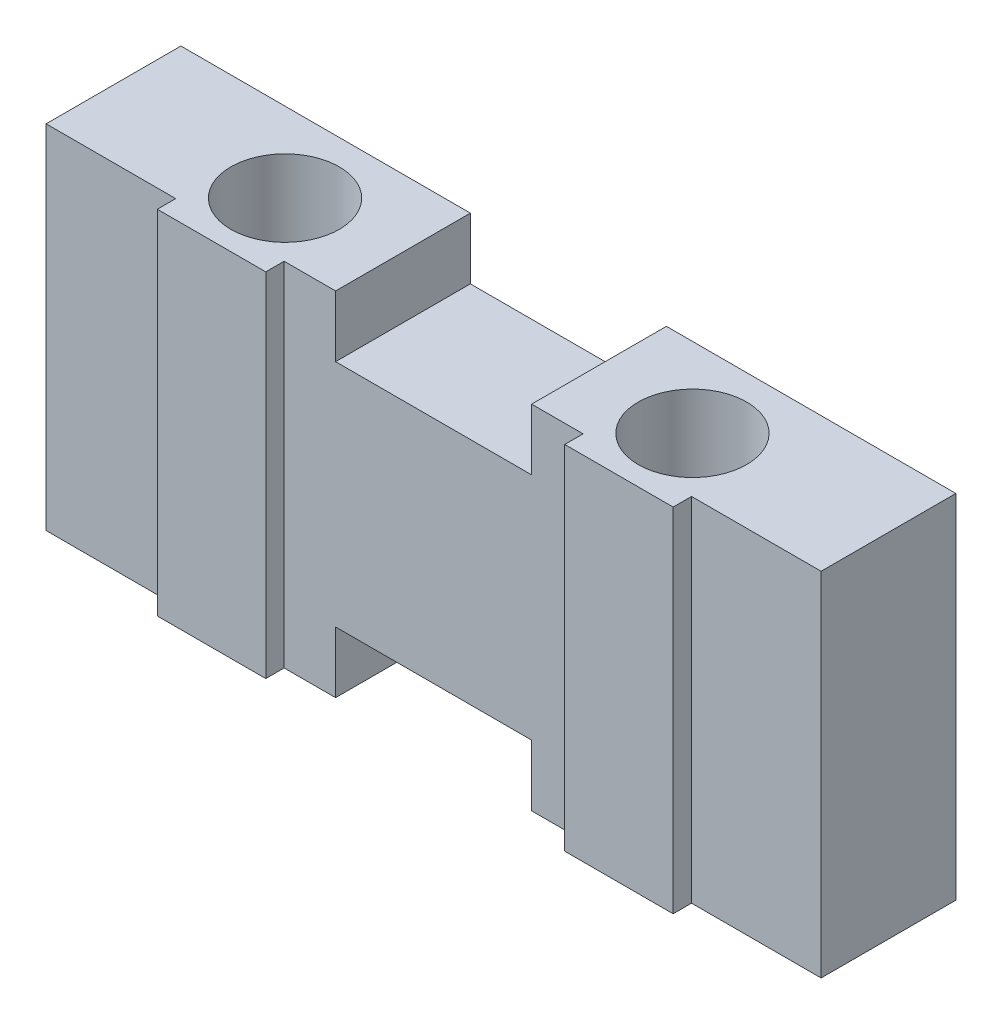
ISO-10303-21;
HEADER;
FILE_DESCRIPTION(('STEP AP214'),'2;1');
FILE_NAME('part.step','',(''),(''),'','','');
FILE_SCHEMA(('AUTOMOTIVE_DESIGN { 1 0 10303 214 1 1 1 1 }'));
ENDSEC;
DATA;
#1=APPLICATION_CONTEXT('core data for automotive mechanical design processes');
#2=APPLICATION_PROTOCOL_DEFINITION('international standard','automotive_design',2000,#1);
#3=PRODUCT_CONTEXT('',#1,'mechanical');
#4=PRODUCT('Part','Part','',(#3));
#5=PRODUCT_RELATED_PRODUCT_CATEGORY('part','',(#4));
#6=PRODUCT_DEFINITION_FORMATION('','',#4);
#7=PRODUCT_DEFINITION_CONTEXT('part definition',#1,'design');
#8=PRODUCT_DEFINITION('design','',#6,#7);
#9=PRODUCT_DEFINITION_SHAPE('','',#8);
#10=(LENGTH_UNIT() NAMED_UNIT(*) SI_UNIT(.MILLI.,.METRE.));
#11=(NAMED_UNIT(*) PLANE_ANGLE_UNIT() SI_UNIT($,.RADIAN.));
#12=(NAMED_UNIT(*) SI_UNIT($,.STERADIAN.) SOLID_ANGLE_UNIT());
#13=UNCERTAINTY_MEASURE_WITH_UNIT(LENGTH_MEASURE(1.E-05),#10,'distance_accuracy_value','');
#14=(GEOMETRIC_REPRESENTATION_CONTEXT(3) GLOBAL_UNCERTAINTY_ASSIGNED_CONTEXT((#13)) GLOBAL_UNIT_ASSIGNED_CONTEXT((#10,
#11,#12)) REPRESENTATION_CONTEXT('',''));
#15=CARTESIAN_POINT('',(0.,0.,0.));
#16=DIRECTION('',(0.,0.,1.));
#17=DIRECTION('',(1.,0.,0.));
#18=AXIS2_PLACEMENT_3D('',#15,#16,#17);
#19=CARTESIAN_POINT('',(-1.6,5.75,2.5));
#20=DIRECTION('',(0.,-1.,0.));
#21=DIRECTION('',(0.,0.,-1.));
#22=AXIS2_PLACEMENT_3D('',#19,#20,#21);
#23=PLANE('',#22);
#24=CARTESIAN_POINT('',(-3.325,5.75,1.3));
#25=DIRECTION('',(0.,1.,0.));
#26=DIRECTION('',(0.,0.,1.));
#27=AXIS2_PLACEMENT_3D('',#24,#25,#26);
#28=CIRCLE('',#27,0.885);
#29=CARTESIAN_POINT('',(-3.325,5.75,2.185));
#30=VERTEX_POINT('',#29);
#31=EDGE_CURVE('E280',#30,#30,#28,.T.);
#32=ORIENTED_EDGE('',*,*,#31,.F.);
#33=EDGE_LOOP('',(#32));
#34=FACE_BOUND('',#33,.T.);
#35=DIRECTION('',(1.,0.,0.));
#36=VECTOR('',#35,1.);
#37=CARTESIAN_POINT('',(-6.325,5.75,2.2));
#38=LINE('',#37,#36);
#39=CARTESIAN_POINT('',(-6.325,5.75,2.2));
#40=VERTEX_POINT('',#39);
#41=CARTESIAN_POINT('',(-4.21,5.75,2.2));
#42=VERTEX_POINT('',#41);
#43=EDGE_CURVE('E48',#40,#42,#38,.T.);
#44=ORIENTED_EDGE('',*,*,#43,.T.);
#45=DIRECTION('',(0.,0.,1.));
#46=VECTOR('',#45,1.);
#47=CARTESIAN_POINT('',(-4.21,5.75,2.2));
#48=LINE('',#47,#46);
#49=CARTESIAN_POINT('',(-4.21,5.75,2.5));
#50=VERTEX_POINT('',#49);
#51=EDGE_CURVE('E185',#42,#50,#48,.T.);
#52=ORIENTED_EDGE('',*,*,#51,.T.);
#53=DIRECTION('',(-1.,0.,0.));
#54=VECTOR('',#53,1.);
#55=CARTESIAN_POINT('',(-1.6,5.75,2.5));
#56=LINE('',#55,#54);
#57=CARTESIAN_POINT('',(-2.44,5.75,2.5));
#58=VERTEX_POINT('',#57);
#59=EDGE_CURVE('E270',#58,#50,#56,.T.);
#60=ORIENTED_EDGE('',*,*,#59,.F.);
#61=DIRECTION('',(0.,0.,-1.));
#62=VECTOR('',#61,1.);
#63=CARTESIAN_POINT('',(-2.44,5.75,0.));
#64=LINE('',#63,#62);
#65=CARTESIAN_POINT('',(-2.44,5.75,2.2));
#66=VERTEX_POINT('',#65);
#67=EDGE_CURVE('E321',#58,#66,#64,.T.);
#68=ORIENTED_EDGE('',*,*,#67,.T.);
#69=DIRECTION('',(1.,0.,0.));
#70=VECTOR('',#69,1.);
#71=CARTESIAN_POINT('',(0.,5.75,2.2));
#72=LINE('',#71,#70);
#73=CARTESIAN_POINT('',(-1.6,5.75,2.2));
#74=VERTEX_POINT('',#73);
#75=EDGE_CURVE('E318',#66,#74,#72,.T.);
#76=ORIENTED_EDGE('',*,*,#75,.T.);
#77=DIRECTION('',(0.,0.,-1.));
#78=VECTOR('',#77,1.);
#79=CARTESIAN_POINT('',(-1.6,5.75,2.5));
#80=LINE('',#79,#78);
#81=CARTESIAN_POINT('',(-1.6,5.75,0.));
#82=VERTEX_POINT('',#81);
#83=EDGE_CURVE('E194',#74,#82,#80,.T.);
#84=ORIENTED_EDGE('',*,*,#83,.T.);
#85=DIRECTION('',(-1.,0.,0.));
#86=VECTOR('',#85,1.);
#87=CARTESIAN_POINT('',(-1.6,5.75,0.));
#88=LINE('',#87,#86);
#89=CARTESIAN_POINT('',(-6.325,5.75,0.));
#90=VERTEX_POINT('',#89);
#91=EDGE_CURVE('E257',#82,#90,#88,.T.);
#92=ORIENTED_EDGE('',*,*,#91,.T.);
#93=DIRECTION('',(0.,0.,-1.));
#94=VECTOR('',#93,1.);
#95=CARTESIAN_POINT('',(-6.325,5.75,2.5));
#96=LINE('',#95,#94);
#97=EDGE_CURVE('E191',#40,#90,#96,.T.);
#98=ORIENTED_EDGE('',*,*,#97,.F.);
#99=EDGE_LOOP('',(#44,#52,#60,#68,#76,#84,#92,#98));
#100=FACE_BOUND('',#99,.T.);
#101=ADVANCED_FACE('F33',(#34,#100),#23,.F.);
#102=CARTESIAN_POINT('',(-6.325,0.,2.5));
#103=DIRECTION('',(0.,1.,0.));
#104=DIRECTION('',(0.,0.,1.));
#105=AXIS2_PLACEMENT_3D('',#102,#103,#104);
#106=PLANE('',#105);
#107=CARTESIAN_POINT('',(-3.325,0.,1.3));
#108=DIRECTION('',(0.,1.,0.));
#109=DIRECTION('',(0.,0.,1.));
#110=AXIS2_PLACEMENT_3D('',#107,#108,#109);
#111=CIRCLE('',#110,0.885);
#112=CARTESIAN_POINT('',(-3.325,0.,2.185));
#113=VERTEX_POINT('',#112);
#114=EDGE_CURVE('E273',#113,#113,#111,.F.);
#115=ORIENTED_EDGE('',*,*,#114,.F.);
#116=EDGE_LOOP('',(#115));
#117=FACE_BOUND('',#116,.T.);
#118=DIRECTION('',(-1.,0.,0.));
#119=VECTOR('',#118,1.);
#120=CARTESIAN_POINT('',(-6.325,0.,2.2));
#121=LINE('',#120,#119);
#122=CARTESIAN_POINT('',(-4.21,0.,2.2));
#123=VERTEX_POINT('',#122);
#124=CARTESIAN_POINT('',(-6.325,0.,2.2));
#125=VERTEX_POINT('',#124);
#126=EDGE_CURVE('E171',#123,#125,#121,.T.);
#127=ORIENTED_EDGE('',*,*,#126,.T.);
#128=DIRECTION('',(0.,0.,-1.));
#129=VECTOR('',#128,1.);
#130=CARTESIAN_POINT('',(-6.325,0.,2.5));
#131=LINE('',#130,#129);
#132=CARTESIAN_POINT('',(-6.325,0.,0.));
#133=VERTEX_POINT('',#132);
#134=EDGE_CURVE('E181',#125,#133,#131,.T.);
#135=ORIENTED_EDGE('',*,*,#134,.T.);
#136=DIRECTION('',(1.,0.,0.));
#137=VECTOR('',#136,1.);
#138=CARTESIAN_POINT('',(-6.325,0.,0.));
#139=LINE('',#138,#137);
#140=CARTESIAN_POINT('',(-1.6,0.,0.));
#141=VERTEX_POINT('',#140);
#142=EDGE_CURVE('E260',#133,#141,#139,.T.);
#143=ORIENTED_EDGE('',*,*,#142,.T.);
#144=DIRECTION('',(0.,0.,-1.));
#145=VECTOR('',#144,1.);
#146=CARTESIAN_POINT('',(-1.6,0.,2.5));
#147=LINE('',#146,#145);
#148=CARTESIAN_POINT('',(-1.6,0.,2.2));
#149=VERTEX_POINT('',#148);
#150=EDGE_CURVE('E192',#149,#141,#147,.T.);
#151=ORIENTED_EDGE('',*,*,#150,.F.);
#152=DIRECTION('',(-1.,0.,0.));
#153=VECTOR('',#152,1.);
#154=CARTESIAN_POINT('',(0.,0.,2.2));
#155=LINE('',#154,#153);
#156=CARTESIAN_POINT('',(-2.44,0.,2.2));
#157=VERTEX_POINT('',#156);
#158=EDGE_CURVE('E299',#149,#157,#155,.T.);
#159=ORIENTED_EDGE('',*,*,#158,.T.);
#160=DIRECTION('',(0.,0.,1.));
#161=VECTOR('',#160,1.);
#162=CARTESIAN_POINT('',(-2.44,0.,0.));
#163=LINE('',#162,#161);
#164=CARTESIAN_POINT('',(-2.44,0.,2.5));
#165=VERTEX_POINT('',#164);
#166=EDGE_CURVE('E331',#157,#165,#163,.T.);
#167=ORIENTED_EDGE('',*,*,#166,.T.);
#168=DIRECTION('',(1.,0.,0.));
#169=VECTOR('',#168,1.);
#170=CARTESIAN_POINT('',(-6.325,0.,2.5));
#171=LINE('',#170,#169);
#172=CARTESIAN_POINT('',(-4.21,0.,2.5));
#173=VERTEX_POINT('',#172);
#174=EDGE_CURVE('E196',#173,#165,#171,.T.);
#175=ORIENTED_EDGE('',*,*,#174,.F.);
#176=DIRECTION('',(0.,0.,-1.));
#177=VECTOR('',#176,1.);
#178=CARTESIAN_POINT('',(-4.21,0.,2.2));
#179=LINE('',#178,#177);
#180=EDGE_CURVE('E184',#173,#123,#179,.T.);
#181=ORIENTED_EDGE('',*,*,#180,.T.);
#182=EDGE_LOOP('',(#127,#135,#143,#151,#159,#167,#175,#181));
#183=FACE_BOUND('',#182,.T.);
#184=ADVANCED_FACE('F179',(#117,#183),#106,.F.);
#185=CARTESIAN_POINT('',(-1.6,1.,2.5));
#186=DIRECTION('',(0.,0.,-1.));
#187=DIRECTION('',(-1.,0.,0.));
#188=AXIS2_PLACEMENT_3D('',#185,#186,#187);
#189=PLANE('',#188);
#190=DIRECTION('',(0.,1.,0.));
#191=VECTOR('',#190,1.);
#192=CARTESIAN_POINT('',(-4.21,-0.00100000000000013,2.5));
#193=LINE('',#192,#191);
#194=EDGE_CURVE('E359',#173,#50,#193,.T.);
#195=ORIENTED_EDGE('',*,*,#194,.F.);
#196=ORIENTED_EDGE('',*,*,#174,.T.);
#197=DIRECTION('',(0.,1.,0.));
#198=VECTOR('',#197,1.);
#199=CARTESIAN_POINT('',(-2.44,-0.00100000000000013,2.5));
#200=LINE('',#199,#198);
#201=EDGE_CURVE('E334',#165,#58,#200,.T.);
#202=ORIENTED_EDGE('',*,*,#201,.T.);
#203=ORIENTED_EDGE('',*,*,#59,.T.);
#204=EDGE_LOOP('',(#195,#196,#202,#203));
#205=FACE_BOUND('',#204,.T.);
#206=ADVANCED_FACE('F369',(#205),#189,.F.);
#207=CARTESIAN_POINT('',(-6.325,5.75,2.5));
#208=DIRECTION('',(1.,0.,0.));
#209=DIRECTION('',(0.,0.,-1.));
#210=AXIS2_PLACEMENT_3D('',#207,#208,#209);
#211=PLANE('',#210);
#212=DIRECTION('',(0.,1.,0.));
#213=VECTOR('',#212,1.);
#214=CARTESIAN_POINT('',(-6.325,-0.00100000000000013,2.2));
#215=LINE('',#214,#213);
#216=EDGE_CURVE('E168',#125,#40,#215,.T.);
#217=ORIENTED_EDGE('',*,*,#216,.T.);
#218=ORIENTED_EDGE('',*,*,#97,.T.);
#219=DIRECTION('',(0.,-1.,0.));
#220=VECTOR('',#219,1.);
#221=CARTESIAN_POINT('',(-6.325,5.75,0.));
#222=LINE('',#221,#220);
#223=EDGE_CURVE('E189',#90,#133,#222,.T.);
#224=ORIENTED_EDGE('',*,*,#223,.T.);
#225=ORIENTED_EDGE('',*,*,#134,.F.);
#226=EDGE_LOOP('',(#217,#218,#224,#225));
#227=FACE_BOUND('',#226,.T.);
#228=ADVANCED_FACE('F187',(#227),#211,.F.);
#229=CARTESIAN_POINT('',(1.6,0.,2.5));
#230=DIRECTION('',(0.,1.,0.));
#231=DIRECTION('',(0.,0.,1.));
#232=AXIS2_PLACEMENT_3D('',#229,#230,#231);
#233=PLANE('',#232);
#234=CARTESIAN_POINT('',(3.325,0.,1.3));
#235=DIRECTION('',(0.,1.,0.));
#236=DIRECTION('',(0.,0.,1.));
#237=AXIS2_PLACEMENT_3D('',#234,#235,#236);
#238=CIRCLE('',#237,0.885);
#239=CARTESIAN_POINT('',(3.325,0.,2.185));
#240=VERTEX_POINT('',#239);
#241=EDGE_CURVE('E288',#240,#240,#238,.F.);
#242=ORIENTED_EDGE('',*,*,#241,.F.);
#243=EDGE_LOOP('',(#242));
#244=FACE_BOUND('',#243,.T.);
#245=DIRECTION('',(0.,0.,1.));
#246=VECTOR('',#245,1.);
#247=CARTESIAN_POINT('',(4.21,0.,0.));
#248=LINE('',#247,#246);
#249=CARTESIAN_POINT('',(4.21,0.,2.2));
#250=VERTEX_POINT('',#249);
#251=CARTESIAN_POINT('',(4.21,0.,2.5));
#252=VERTEX_POINT('',#251);
#253=EDGE_CURVE('E341',#250,#252,#248,.T.);
#254=ORIENTED_EDGE('',*,*,#253,.T.);
#255=DIRECTION('',(1.,0.,0.));
#256=VECTOR('',#255,1.);
#257=CARTESIAN_POINT('',(1.6,0.,2.5));
#258=LINE('',#257,#256);
#259=CARTESIAN_POINT('',(2.44,0.,2.5));
#260=VERTEX_POINT('',#259);
#261=EDGE_CURVE('E261',#260,#252,#258,.T.);
#262=ORIENTED_EDGE('',*,*,#261,.F.);
#263=DIRECTION('',(0.,0.,-1.));
#264=VECTOR('',#263,1.);
#265=CARTESIAN_POINT('',(2.44,0.,0.));
#266=LINE('',#265,#264);
#267=CARTESIAN_POINT('',(2.44,0.,2.2));
#268=VERTEX_POINT('',#267);
#269=EDGE_CURVE('E305',#260,#268,#266,.T.);
#270=ORIENTED_EDGE('',*,*,#269,.T.);
#271=DIRECTION('',(-1.,0.,0.));
#272=VECTOR('',#271,1.);
#273=CARTESIAN_POINT('',(0.,0.,2.2));
#274=LINE('',#273,#272);
#275=CARTESIAN_POINT('',(1.6,0.,2.2));
#276=VERTEX_POINT('',#275);
#277=EDGE_CURVE('E308',#268,#276,#274,.T.);
#278=ORIENTED_EDGE('',*,*,#277,.T.);
#279=DIRECTION('',(0.,0.,-1.));
#280=VECTOR('',#279,1.);
#281=CARTESIAN_POINT('',(1.6,0.,2.5));
#282=LINE('',#281,#280);
#283=CARTESIAN_POINT('',(1.6,0.,0.));
#284=VERTEX_POINT('',#283);
#285=EDGE_CURVE('E211',#276,#284,#282,.T.);
#286=ORIENTED_EDGE('',*,*,#285,.T.);
#287=DIRECTION('',(1.,0.,0.));
#288=VECTOR('',#287,1.);
#289=CARTESIAN_POINT('',(1.6,0.,0.));
#290=LINE('',#289,#288);
#291=CARTESIAN_POINT('',(6.325,0.,0.));
#292=VERTEX_POINT('',#291);
#293=EDGE_CURVE('E237',#284,#292,#290,.T.);
#294=ORIENTED_EDGE('',*,*,#293,.T.);
#295=DIRECTION('',(0.,0.,-1.));
#296=VECTOR('',#295,1.);
#297=CARTESIAN_POINT('',(6.325,0.,2.5));
#298=LINE('',#297,#296);
#299=CARTESIAN_POINT('',(6.325,0.,2.2));
#300=VERTEX_POINT('',#299);
#301=EDGE_CURVE('E209',#300,#292,#298,.T.);
#302=ORIENTED_EDGE('',*,*,#301,.F.);
#303=DIRECTION('',(-1.,0.,0.));
#304=VECTOR('',#303,1.);
#305=CARTESIAN_POINT('',(0.,0.,2.2));
#306=LINE('',#305,#304);
#307=EDGE_CURVE('E56',#300,#250,#306,.T.);
#308=ORIENTED_EDGE('',*,*,#307,.T.);
#309=EDGE_LOOP('',(#254,#262,#270,#278,#286,#294,#302,#308));
#310=FACE_BOUND('',#309,.T.);
#311=ADVANCED_FACE('F410',(#244,#310),#233,.F.);
#312=CARTESIAN_POINT('',(6.325,5.75,2.5));
#313=DIRECTION('',(0.,-1.,0.));
#314=DIRECTION('',(0.,0.,-1.));
#315=AXIS2_PLACEMENT_3D('',#312,#313,#314);
#316=PLANE('',#315);
#317=CARTESIAN_POINT('',(3.325,5.75,1.3));
#318=DIRECTION('',(0.,1.,0.));
#319=DIRECTION('',(0.,0.,1.));
#320=AXIS2_PLACEMENT_3D('',#317,#318,#319);
#321=CIRCLE('',#320,0.885);
#322=CARTESIAN_POINT('',(3.325,5.75,2.185));
#323=VERTEX_POINT('',#322);
#324=EDGE_CURVE('E284',#323,#323,#321,.T.);
#325=ORIENTED_EDGE('',*,*,#324,.F.);
#326=EDGE_LOOP('',(#325));
#327=FACE_BOUND('',#326,.T.);
#328=DIRECTION('',(0.,0.,-1.));
#329=VECTOR('',#328,1.);
#330=CARTESIAN_POINT('',(4.21,5.75,0.));
#331=LINE('',#330,#329);
#332=CARTESIAN_POINT('',(4.21,5.75,2.5));
#333=VERTEX_POINT('',#332);
#334=CARTESIAN_POINT('',(4.21,5.75,2.2));
#335=VERTEX_POINT('',#334);
#336=EDGE_CURVE('E347',#333,#335,#331,.T.);
#337=ORIENTED_EDGE('',*,*,#336,.T.);
#338=DIRECTION('',(1.,0.,0.));
#339=VECTOR('',#338,1.);
#340=CARTESIAN_POINT('',(0.,5.75,2.2));
#341=LINE('',#340,#339);
#342=CARTESIAN_POINT('',(6.325,5.75,2.2));
#343=VERTEX_POINT('',#342);
#344=EDGE_CURVE('E344',#335,#343,#341,.T.);
#345=ORIENTED_EDGE('',*,*,#344,.T.);
#346=DIRECTION('',(0.,0.,-1.));
#347=VECTOR('',#346,1.);
#348=CARTESIAN_POINT('',(6.325,5.75,2.5));
#349=LINE('',#348,#347);
#350=CARTESIAN_POINT('',(6.325,5.75,0.));
#351=VERTEX_POINT('',#350);
#352=EDGE_CURVE('E207',#343,#351,#349,.T.);
#353=ORIENTED_EDGE('',*,*,#352,.T.);
#354=DIRECTION('',(-1.,0.,0.));
#355=VECTOR('',#354,1.);
#356=CARTESIAN_POINT('',(6.325,5.75,0.));
#357=LINE('',#356,#355);
#358=CARTESIAN_POINT('',(1.6,5.75,0.));
#359=VERTEX_POINT('',#358);
#360=EDGE_CURVE('E245',#351,#359,#357,.T.);
#361=ORIENTED_EDGE('',*,*,#360,.T.);
#362=DIRECTION('',(0.,0.,-1.));
#363=VECTOR('',#362,1.);
#364=CARTESIAN_POINT('',(1.6,5.75,2.5));
#365=LINE('',#364,#363);
#366=CARTESIAN_POINT('',(1.6,5.75,2.2));
#367=VERTEX_POINT('',#366);
#368=EDGE_CURVE('E205',#367,#359,#365,.T.);
#369=ORIENTED_EDGE('',*,*,#368,.F.);
#370=CARTESIAN_POINT('',(2.44,5.75,2.2));
#371=VERTEX_POINT('',#370);
#372=EDGE_CURVE('E317',#367,#371,#72,.T.);
#373=ORIENTED_EDGE('',*,*,#372,.T.);
#374=DIRECTION('',(0.,0.,1.));
#375=VECTOR('',#374,1.);
#376=CARTESIAN_POINT('',(2.44,5.75,0.));
#377=LINE('',#376,#375);
#378=CARTESIAN_POINT('',(2.44,5.75,2.5));
#379=VERTEX_POINT('',#378);
#380=EDGE_CURVE('E324',#371,#379,#377,.T.);
#381=ORIENTED_EDGE('',*,*,#380,.T.);
#382=DIRECTION('',(-1.,0.,0.));
#383=VECTOR('',#382,1.);
#384=CARTESIAN_POINT('',(6.325,5.75,2.5));
#385=LINE('',#384,#383);
#386=EDGE_CURVE('E264',#333,#379,#385,.T.);
#387=ORIENTED_EDGE('',*,*,#386,.F.);
#388=EDGE_LOOP('',(#337,#345,#353,#361,#369,#373,#381,#387));
#389=FACE_BOUND('',#388,.T.);
#390=ADVANCED_FACE('F408',(#327,#389),#316,.F.);
#391=DIRECTION('',(0.,1.,0.));
#392=VECTOR('',#391,1.);
#393=CARTESIAN_POINT('',(4.21,-0.00100000000000013,2.5));
#394=LINE('',#393,#392);
#395=EDGE_CURVE('E351',#252,#333,#394,.T.);
#396=ORIENTED_EDGE('',*,*,#395,.T.);
#397=ORIENTED_EDGE('',*,*,#386,.T.);
#398=DIRECTION('',(0.,1.,0.));
#399=VECTOR('',#398,1.);
#400=CARTESIAN_POINT('',(2.44,-0.00100000000000013,2.5));
#401=LINE('',#400,#399);
#402=EDGE_CURVE('E330',#260,#379,#401,.T.);
#403=ORIENTED_EDGE('',*,*,#402,.F.);
#404=ORIENTED_EDGE('',*,*,#261,.T.);
#405=EDGE_LOOP('',(#396,#397,#403,#404));
#406=FACE_BOUND('',#405,.T.);
#407=ADVANCED_FACE('F383',(#406),#189,.F.);
#408=CARTESIAN_POINT('',(6.325,0.,2.5));
#409=DIRECTION('',(-1.,0.,0.));
#410=DIRECTION('',(0.,0.,1.));
#411=AXIS2_PLACEMENT_3D('',#408,#409,#410);
#412=PLANE('',#411);
#413=DIRECTION('',(0.,1.,0.));
#414=VECTOR('',#413,1.);
#415=CARTESIAN_POINT('',(6.325,-0.00100000000000013,2.2));
#416=LINE('',#415,#414);
#417=EDGE_CURVE('E350',#300,#343,#416,.T.);
#418=ORIENTED_EDGE('',*,*,#417,.F.);
#419=ORIENTED_EDGE('',*,*,#301,.T.);
#420=DIRECTION('',(0.,1.,0.));
#421=VECTOR('',#420,1.);
#422=CARTESIAN_POINT('',(6.325,0.,0.));
#423=LINE('',#422,#421);
#424=EDGE_CURVE('E239',#292,#351,#423,.T.);
#425=ORIENTED_EDGE('',*,*,#424,.T.);
#426=ORIENTED_EDGE('',*,*,#352,.F.);
#427=EDGE_LOOP('',(#418,#419,#425,#426));
#428=FACE_BOUND('',#427,.T.);
#429=ADVANCED_FACE('F378',(#428),#412,.F.);
#430=CARTESIAN_POINT('',(-1.6,0.,2.5));
#431=DIRECTION('',(-1.,0.,0.));
#432=DIRECTION('',(0.,0.,1.));
#433=AXIS2_PLACEMENT_3D('',#430,#431,#432);
#434=PLANE('',#433);
#435=DIRECTION('',(0.,-1.,0.));
#436=VECTOR('',#435,1.);
#437=CARTESIAN_POINT('',(-1.6,-0.00100000000000013,2.2));
#438=LINE('',#437,#436);
#439=CARTESIAN_POINT('',(-1.6,1.,2.2));
#440=VERTEX_POINT('',#439);
#441=EDGE_CURVE('E314',#440,#149,#438,.T.);
#442=ORIENTED_EDGE('',*,*,#441,.T.);
#443=ORIENTED_EDGE('',*,*,#150,.T.);
#444=DIRECTION('',(0.,1.,0.));
#445=VECTOR('',#444,1.);
#446=CARTESIAN_POINT('',(-1.6,0.,0.));
#447=LINE('',#446,#445);
#448=CARTESIAN_POINT('',(-1.6,1.,0.));
#449=VERTEX_POINT('',#448);
#450=EDGE_CURVE('E232',#141,#449,#447,.T.);
#451=ORIENTED_EDGE('',*,*,#450,.T.);
#452=DIRECTION('',(0.,0.,-1.));
#453=VECTOR('',#452,1.);
#454=CARTESIAN_POINT('',(-1.6,1.,2.5));
#455=LINE('',#454,#453);
#456=EDGE_CURVE('E11',#440,#449,#455,.T.);
#457=ORIENTED_EDGE('',*,*,#456,.F.);
#458=EDGE_LOOP('',(#442,#443,#451,#457));
#459=FACE_BOUND('',#458,.T.);
#460=ADVANCED_FACE('F35',(#459),#434,.F.);
#461=CARTESIAN_POINT('',(-1.6,1.,2.5));
#462=DIRECTION('',(0.,1.,0.));
#463=DIRECTION('',(0.,0.,1.));
#464=AXIS2_PLACEMENT_3D('',#461,#462,#463);
#465=PLANE('',#464);
#466=DIRECTION('',(-1.,0.,0.));
#467=VECTOR('',#466,1.);
#468=CARTESIAN_POINT('',(0.,1.,2.2));
#469=LINE('',#468,#467);
#470=CARTESIAN_POINT('',(1.6,1.,2.2));
#471=VERTEX_POINT('',#470);
#472=EDGE_CURVE('E312',#471,#440,#469,.T.);
#473=ORIENTED_EDGE('',*,*,#472,.T.);
#474=ORIENTED_EDGE('',*,*,#456,.T.);
#475=DIRECTION('',(1.,0.,0.));
#476=VECTOR('',#475,1.);
#477=CARTESIAN_POINT('',(-1.6,1.,0.));
#478=LINE('',#477,#476);
#479=CARTESIAN_POINT('',(1.6,1.,0.));
#480=VERTEX_POINT('',#479);
#481=EDGE_CURVE('E226',#449,#480,#478,.T.);
#482=ORIENTED_EDGE('',*,*,#481,.T.);
#483=DIRECTION('',(0.,0.,-1.));
#484=VECTOR('',#483,1.);
#485=CARTESIAN_POINT('',(1.6,1.,2.5));
#486=LINE('',#485,#484);
#487=EDGE_CURVE('E41',#471,#480,#486,.T.);
#488=ORIENTED_EDGE('',*,*,#487,.F.);
#489=EDGE_LOOP('',(#473,#474,#482,#488));
#490=FACE_BOUND('',#489,.T.);
#491=ADVANCED_FACE('F227',(#490),#465,.F.);
#492=CARTESIAN_POINT('',(1.6,1.,2.5));
#493=DIRECTION('',(1.,0.,0.));
#494=DIRECTION('',(0.,1.,0.));
#495=AXIS2_PLACEMENT_3D('',#492,#493,#494);
#496=PLANE('',#495);
#497=DIRECTION('',(0.,1.,0.));
#498=VECTOR('',#497,1.);
#499=CARTESIAN_POINT('',(1.6,-0.00100000000000083,2.2));
#500=LINE('',#499,#498);
#501=EDGE_CURVE('E222',#276,#471,#500,.T.);
#502=ORIENTED_EDGE('',*,*,#501,.T.);
#503=ORIENTED_EDGE('',*,*,#487,.T.);
#504=DIRECTION('',(0.,-1.,0.));
#505=VECTOR('',#504,1.);
#506=CARTESIAN_POINT('',(1.6,1.,0.));
#507=LINE('',#506,#505);
#508=EDGE_CURVE('E220',#480,#284,#507,.T.);
#509=ORIENTED_EDGE('',*,*,#508,.T.);
#510=ORIENTED_EDGE('',*,*,#285,.F.);
#511=EDGE_LOOP('',(#502,#503,#509,#510));
#512=FACE_BOUND('',#511,.T.);
#513=ADVANCED_FACE('F217',(#512),#496,.F.);
#514=CARTESIAN_POINT('',(1.6,5.75,2.5));
#515=DIRECTION('',(1.,0.,0.));
#516=DIRECTION('',(0.,0.,-1.));
#517=AXIS2_PLACEMENT_3D('',#514,#515,#516);
#518=PLANE('',#517);
#519=DIRECTION('',(0.,1.,0.));
#520=VECTOR('',#519,1.);
#521=CARTESIAN_POINT('',(1.6,-0.00100000000000013,2.2));
#522=LINE('',#521,#520);
#523=CARTESIAN_POINT('',(1.6,4.75,2.2));
#524=VERTEX_POINT('',#523);
#525=EDGE_CURVE('E296',#524,#367,#522,.T.);
#526=ORIENTED_EDGE('',*,*,#525,.T.);
#527=ORIENTED_EDGE('',*,*,#368,.T.);
#528=DIRECTION('',(0.,-1.,0.));
#529=VECTOR('',#528,1.);
#530=CARTESIAN_POINT('',(1.6,5.75,0.));
#531=LINE('',#530,#529);
#532=CARTESIAN_POINT('',(1.6,4.75,0.));
#533=VERTEX_POINT('',#532);
#534=EDGE_CURVE('E248',#359,#533,#531,.T.);
#535=ORIENTED_EDGE('',*,*,#534,.T.);
#536=DIRECTION('',(0.,0.,-1.));
#537=VECTOR('',#536,1.);
#538=CARTESIAN_POINT('',(1.6,4.75,2.5));
#539=LINE('',#538,#537);
#540=EDGE_CURVE('E203',#524,#533,#539,.T.);
#541=ORIENTED_EDGE('',*,*,#540,.F.);
#542=EDGE_LOOP('',(#526,#527,#535,#541));
#543=FACE_BOUND('',#542,.T.);
#544=ADVANCED_FACE('F403',(#543),#518,.F.);
#545=CARTESIAN_POINT('',(1.6,4.75,2.5));
#546=DIRECTION('',(0.,-1.,0.));
#547=DIRECTION('',(0.,0.,-1.));
#548=AXIS2_PLACEMENT_3D('',#545,#546,#547);
#549=PLANE('',#548);
#550=DIRECTION('',(1.,0.,0.));
#551=VECTOR('',#550,1.);
#552=CARTESIAN_POINT('',(0.,4.75,2.2));
#553=LINE('',#552,#551);
#554=CARTESIAN_POINT('',(-1.6,4.75,2.2));
#555=VERTEX_POINT('',#554);
#556=EDGE_CURVE('E302',#555,#524,#553,.T.);
#557=ORIENTED_EDGE('',*,*,#556,.T.);
#558=ORIENTED_EDGE('',*,*,#540,.T.);
#559=DIRECTION('',(-1.,0.,0.));
#560=VECTOR('',#559,1.);
#561=CARTESIAN_POINT('',(1.6,4.75,0.));
#562=LINE('',#561,#560);
#563=CARTESIAN_POINT('',(-1.6,4.75,0.));
#564=VERTEX_POINT('',#563);
#565=EDGE_CURVE('E251',#533,#564,#562,.T.);
#566=ORIENTED_EDGE('',*,*,#565,.T.);
#567=DIRECTION('',(0.,0.,-1.));
#568=VECTOR('',#567,1.);
#569=CARTESIAN_POINT('',(-1.6,4.75,2.5));
#570=LINE('',#569,#568);
#571=EDGE_CURVE('E201',#555,#564,#570,.T.);
#572=ORIENTED_EDGE('',*,*,#571,.F.);
#573=EDGE_LOOP('',(#557,#558,#566,#572));
#574=FACE_BOUND('',#573,.T.);
#575=ADVANCED_FACE('F399',(#574),#549,.F.);
#576=CARTESIAN_POINT('',(-1.6,4.75,2.5));
#577=DIRECTION('',(-1.,0.,0.));
#578=DIRECTION('',(0.,0.,1.));
#579=AXIS2_PLACEMENT_3D('',#576,#577,#578);
#580=PLANE('',#579);
#581=DIRECTION('',(0.,-1.,0.));
#582=VECTOR('',#581,1.);
#583=CARTESIAN_POINT('',(-1.6,-0.00100000000000013,2.2));
#584=LINE('',#583,#582);
#585=EDGE_CURVE('E293',#74,#555,#584,.T.);
#586=ORIENTED_EDGE('',*,*,#585,.T.);
#587=ORIENTED_EDGE('',*,*,#571,.T.);
#588=DIRECTION('',(0.,1.,0.));
#589=VECTOR('',#588,1.);
#590=CARTESIAN_POINT('',(-1.6,4.75,0.));
#591=LINE('',#590,#589);
#592=EDGE_CURVE('E254',#564,#82,#591,.T.);
#593=ORIENTED_EDGE('',*,*,#592,.T.);
#594=ORIENTED_EDGE('',*,*,#83,.F.);
#595=EDGE_LOOP('',(#586,#587,#593,#594));
#596=FACE_BOUND('',#595,.T.);
#597=ADVANCED_FACE('F396',(#596),#580,.F.);
#598=CARTESIAN_POINT('',(-1.6,1.,0.));
#599=DIRECTION('',(0.,0.,-1.));
#600=DIRECTION('',(-1.,0.,0.));
#601=AXIS2_PLACEMENT_3D('',#598,#599,#600);
#602=PLANE('',#601);
#603=ORIENTED_EDGE('',*,*,#450,.F.);
#604=ORIENTED_EDGE('',*,*,#142,.F.);
#605=ORIENTED_EDGE('',*,*,#223,.F.);
#606=ORIENTED_EDGE('',*,*,#91,.F.);
#607=ORIENTED_EDGE('',*,*,#592,.F.);
#608=ORIENTED_EDGE('',*,*,#565,.F.);
#609=ORIENTED_EDGE('',*,*,#534,.F.);
#610=ORIENTED_EDGE('',*,*,#360,.F.);
#611=ORIENTED_EDGE('',*,*,#424,.F.);
#612=ORIENTED_EDGE('',*,*,#293,.F.);
#613=ORIENTED_EDGE('',*,*,#508,.F.);
#614=ORIENTED_EDGE('',*,*,#481,.F.);
#615=EDGE_LOOP('',(#603,#604,#605,#606,#607,#608,#609,#610,#611,#612,#613,#614));
#616=FACE_BOUND('',#615,.T.);
#617=ADVANCED_FACE('F234',(#616),#602,.T.);
#618=CARTESIAN_POINT('',(-3.325,-0.00100000000000013,1.3));
#619=DIRECTION('',(0.,1.,0.));
#620=DIRECTION('',(0.,0.,1.));
#621=AXIS2_PLACEMENT_3D('',#618,#619,#620);
#622=CYLINDRICAL_SURFACE('',#621,0.885);
#623=ORIENTED_EDGE('',*,*,#31,.T.);
#624=EDGE_LOOP('',(#623));
#625=FACE_BOUND('',#624,.T.);
#626=ORIENTED_EDGE('',*,*,#114,.T.);
#627=EDGE_LOOP('',(#626));
#628=FACE_BOUND('',#627,.T.);
#629=ADVANCED_FACE('F440',(#625,#628),#622,.F.);
#630=CARTESIAN_POINT('',(3.325,-0.00100000000000013,1.3));
#631=DIRECTION('',(0.,1.,0.));
#632=DIRECTION('',(0.,0.,1.));
#633=AXIS2_PLACEMENT_3D('',#630,#631,#632);
#634=CYLINDRICAL_SURFACE('',#633,0.885);
#635=ORIENTED_EDGE('',*,*,#324,.T.);
#636=EDGE_LOOP('',(#635));
#637=FACE_BOUND('',#636,.T.);
#638=ORIENTED_EDGE('',*,*,#241,.T.);
#639=EDGE_LOOP('',(#638));
#640=FACE_BOUND('',#639,.T.);
#641=ADVANCED_FACE('F446',(#637,#640),#634,.F.);
#642=CARTESIAN_POINT('',(0.,-0.00100000000000013,2.2));
#643=DIRECTION('',(0.,0.,1.));
#644=DIRECTION('',(1.,0.,0.));
#645=AXIS2_PLACEMENT_3D('',#642,#643,#644);
#646=PLANE('',#645);
#647=ORIENTED_EDGE('',*,*,#556,.F.);
#648=ORIENTED_EDGE('',*,*,#585,.F.);
#649=ORIENTED_EDGE('',*,*,#75,.F.);
#650=DIRECTION('',(0.,1.,0.));
#651=VECTOR('',#650,1.);
#652=CARTESIAN_POINT('',(-2.44,-0.00100000000000013,2.2));
#653=LINE('',#652,#651);
#654=EDGE_CURVE('E327',#157,#66,#653,.T.);
#655=ORIENTED_EDGE('',*,*,#654,.F.);
#656=ORIENTED_EDGE('',*,*,#158,.F.);
#657=ORIENTED_EDGE('',*,*,#441,.F.);
#658=ORIENTED_EDGE('',*,*,#472,.F.);
#659=ORIENTED_EDGE('',*,*,#501,.F.);
#660=ORIENTED_EDGE('',*,*,#277,.F.);
#661=DIRECTION('',(0.,1.,0.));
#662=VECTOR('',#661,1.);
#663=CARTESIAN_POINT('',(2.44,-0.00100000000000013,2.2));
#664=LINE('',#663,#662);
#665=EDGE_CURVE('E328',#268,#371,#664,.T.);
#666=ORIENTED_EDGE('',*,*,#665,.T.);
#667=ORIENTED_EDGE('',*,*,#372,.F.);
#668=ORIENTED_EDGE('',*,*,#525,.F.);
#669=EDGE_LOOP('',(#647,#648,#649,#655,#656,#657,#658,#659,#660,#666,#667,#668));
#670=FACE_BOUND('',#669,.T.);
#671=ADVANCED_FACE('F375',(#670),#646,.T.);
#672=CARTESIAN_POINT('',(2.44,-0.00100000000000013,0.));
#673=DIRECTION('',(-1.,0.,0.));
#674=DIRECTION('',(0.,0.,1.));
#675=AXIS2_PLACEMENT_3D('',#672,#673,#674);
#676=PLANE('',#675);
#677=ORIENTED_EDGE('',*,*,#402,.T.);
#678=ORIENTED_EDGE('',*,*,#380,.F.);
#679=ORIENTED_EDGE('',*,*,#665,.F.);
#680=ORIENTED_EDGE('',*,*,#269,.F.);
#681=EDGE_LOOP('',(#677,#678,#679,#680));
#682=FACE_BOUND('',#681,.T.);
#683=ADVANCED_FACE('F460',(#682),#676,.T.);
#684=CARTESIAN_POINT('',(-2.44,-0.00100000000000013,0.));
#685=DIRECTION('',(1.,0.,0.));
#686=DIRECTION('',(0.,0.,-1.));
#687=AXIS2_PLACEMENT_3D('',#684,#685,#686);
#688=PLANE('',#687);
#689=ORIENTED_EDGE('',*,*,#654,.T.);
#690=ORIENTED_EDGE('',*,*,#67,.F.);
#691=ORIENTED_EDGE('',*,*,#201,.F.);
#692=ORIENTED_EDGE('',*,*,#166,.F.);
#693=EDGE_LOOP('',(#689,#690,#691,#692));
#694=FACE_BOUND('',#693,.T.);
#695=ADVANCED_FACE('F372',(#694),#688,.T.);
#696=CARTESIAN_POINT('',(4.21,-0.00100000000000013,0.));
#697=DIRECTION('',(1.,0.,0.));
#698=DIRECTION('',(0.,0.,-1.));
#699=AXIS2_PLACEMENT_3D('',#696,#697,#698);
#700=PLANE('',#699);
#701=DIRECTION('',(0.,1.,0.));
#702=VECTOR('',#701,1.);
#703=CARTESIAN_POINT('',(4.21,-0.00100000000000013,2.2));
#704=LINE('',#703,#702);
#705=EDGE_CURVE('E353',#250,#335,#704,.T.);
#706=ORIENTED_EDGE('',*,*,#705,.T.);
#707=ORIENTED_EDGE('',*,*,#336,.F.);
#708=ORIENTED_EDGE('',*,*,#395,.F.);
#709=ORIENTED_EDGE('',*,*,#253,.F.);
#710=EDGE_LOOP('',(#706,#707,#708,#709));
#711=FACE_BOUND('',#710,.T.);
#712=ADVANCED_FACE('F474',(#711),#700,.T.);
#713=CARTESIAN_POINT('',(0.,-0.00100000000000013,2.2));
#714=DIRECTION('',(0.,0.,1.));
#715=DIRECTION('',(1.,0.,0.));
#716=AXIS2_PLACEMENT_3D('',#713,#714,#715);
#717=PLANE('',#716);
#718=ORIENTED_EDGE('',*,*,#417,.T.);
#719=ORIENTED_EDGE('',*,*,#344,.F.);
#720=ORIENTED_EDGE('',*,*,#705,.F.);
#721=ORIENTED_EDGE('',*,*,#307,.F.);
#722=EDGE_LOOP('',(#718,#719,#720,#721));
#723=FACE_BOUND('',#722,.T.);
#724=ADVANCED_FACE('F481',(#723),#717,.T.);
#725=CARTESIAN_POINT('',(-6.325,-0.00100000000000013,2.2));
#726=DIRECTION('',(0.,0.,1.));
#727=DIRECTION('',(1.,0.,0.));
#728=AXIS2_PLACEMENT_3D('',#725,#726,#727);
#729=PLANE('',#728);
#730=DIRECTION('',(0.,1.,0.));
#731=VECTOR('',#730,1.);
#732=CARTESIAN_POINT('',(-4.21,-0.00100000000000013,2.2));
#733=LINE('',#732,#731);
#734=EDGE_CURVE('E176',#123,#42,#733,.T.);
#735=ORIENTED_EDGE('',*,*,#734,.T.);
#736=ORIENTED_EDGE('',*,*,#43,.F.);
#737=ORIENTED_EDGE('',*,*,#216,.F.);
#738=ORIENTED_EDGE('',*,*,#126,.F.);
#739=EDGE_LOOP('',(#735,#736,#737,#738));
#740=FACE_BOUND('',#739,.T.);
#741=ADVANCED_FACE('F170',(#740),#729,.T.);
#742=CARTESIAN_POINT('',(-4.21,-0.00100000000000013,2.2));
#743=DIRECTION('',(-1.,0.,0.));
#744=DIRECTION('',(0.,0.,1.));
#745=AXIS2_PLACEMENT_3D('',#742,#743,#744);
#746=PLANE('',#745);
#747=ORIENTED_EDGE('',*,*,#194,.T.);
#748=ORIENTED_EDGE('',*,*,#51,.F.);
#749=ORIENTED_EDGE('',*,*,#734,.F.);
#750=ORIENTED_EDGE('',*,*,#180,.F.);
#751=EDGE_LOOP('',(#747,#748,#749,#750));
#752=FACE_BOUND('',#751,.T.);
#753=ADVANCED_FACE('F365',(#752),#746,.T.);
#754=CLOSED_SHELL('',(#101,#184,#206,#228,#311,#390,#407,#429,#460,#491,#513,#544,#575,#597,
#617,#629,#641,#671,#683,#695,#712,#724,#741,#753));
#755=MANIFOLD_SOLID_BREP('B2',#754);
#756=ADVANCED_BREP_SHAPE_REPRESENTATION('',(#18,#755),#14);
#757=SHAPE_DEFINITION_REPRESENTATION(#9,#756);
ENDSEC;
END-ISO-10303-21;
